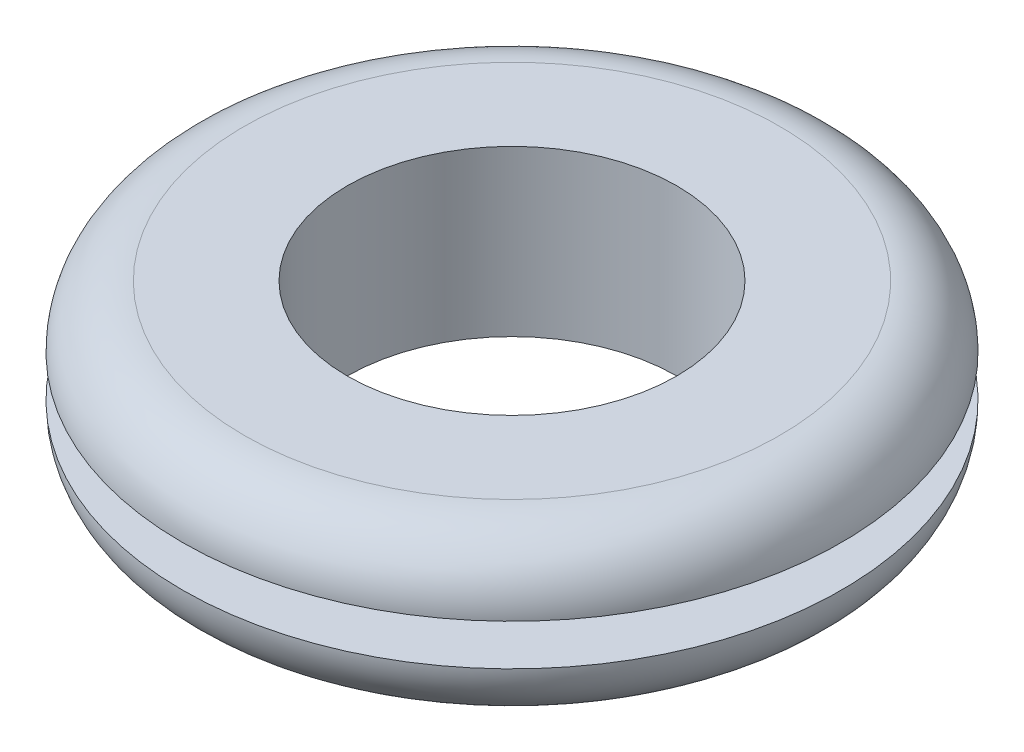
ISO-10303-21;
HEADER;
FILE_DESCRIPTION(('STEP AP214'),'2;1');
FILE_NAME('part.step','',(''),(''),'','','');
FILE_SCHEMA(('AUTOMOTIVE_DESIGN { 1 0 10303 214 1 1 1 1 }'));
ENDSEC;
DATA;
#1=APPLICATION_CONTEXT('core data for automotive mechanical design processes');
#2=APPLICATION_PROTOCOL_DEFINITION('international standard','automotive_design',2000,#1);
#3=PRODUCT_CONTEXT('',#1,'mechanical');
#4=PRODUCT('Part','Part','',(#3));
#5=PRODUCT_RELATED_PRODUCT_CATEGORY('part','',(#4));
#6=PRODUCT_DEFINITION_FORMATION('','',#4);
#7=PRODUCT_DEFINITION_CONTEXT('part definition',#1,'design');
#8=PRODUCT_DEFINITION('design','',#6,#7);
#9=PRODUCT_DEFINITION_SHAPE('','',#8);
#10=(LENGTH_UNIT() NAMED_UNIT(*) SI_UNIT(.MILLI.,.METRE.));
#11=(NAMED_UNIT(*) PLANE_ANGLE_UNIT() SI_UNIT($,.RADIAN.));
#12=(NAMED_UNIT(*) SI_UNIT($,.STERADIAN.) SOLID_ANGLE_UNIT());
#13=UNCERTAINTY_MEASURE_WITH_UNIT(LENGTH_MEASURE(1.E-05),#10,'distance_accuracy_value','');
#14=(GEOMETRIC_REPRESENTATION_CONTEXT(3) GLOBAL_UNCERTAINTY_ASSIGNED_CONTEXT((#13)) GLOBAL_UNIT_ASSIGNED_CONTEXT((#10,
#11,#12)) REPRESENTATION_CONTEXT('',''));
#15=CARTESIAN_POINT('',(0.,0.,0.));
#16=DIRECTION('',(0.,0.,1.));
#17=DIRECTION('',(1.,0.,0.));
#18=AXIS2_PLACEMENT_3D('',#15,#16,#17);
#19=CARTESIAN_POINT('',(0.,3.175,0.));
#20=DIRECTION('',(0.,1.,0.));
#21=DIRECTION('',(0.,0.,1.));
#22=AXIS2_PLACEMENT_3D('',#19,#20,#21);
#23=CYLINDRICAL_SURFACE('',#22,9.525);
#24=CARTESIAN_POINT('',(0.,0.79375,0.));
#25=DIRECTION('',(0.,1.,0.));
#26=DIRECTION('',(0.,0.,1.));
#27=AXIS2_PLACEMENT_3D('',#24,#25,#26);
#28=CIRCLE('',#27,9.525);
#29=CARTESIAN_POINT('',(0.,0.79375,9.525));
#30=VERTEX_POINT('',#29);
#31=EDGE_CURVE('E10',#30,#30,#28,.T.);
#32=ORIENTED_EDGE('',*,*,#31,.F.);
#33=EDGE_LOOP('',(#32));
#34=FACE_BOUND('',#33,.T.);
#35=CARTESIAN_POINT('',(0.,-0.79375,0.));
#36=DIRECTION('',(0.,1.,0.));
#37=DIRECTION('',(0.,0.,1.));
#38=AXIS2_PLACEMENT_3D('',#35,#36,#37);
#39=CIRCLE('',#38,9.525);
#40=CARTESIAN_POINT('',(0.,-0.79375,9.525));
#41=VERTEX_POINT('',#40);
#42=EDGE_CURVE('E56',#41,#41,#39,.T.);
#43=ORIENTED_EDGE('',*,*,#42,.T.);
#44=EDGE_LOOP('',(#43));
#45=FACE_BOUND('',#44,.T.);
#46=ADVANCED_FACE('F28',(#34,#45),#23,.T.);
#47=CARTESIAN_POINT('',(9.525,0.79375,0.));
#48=DIRECTION('',(0.,1.,0.));
#49=DIRECTION('',(0.,0.,1.));
#50=AXIS2_PLACEMENT_3D('',#47,#48,#49);
#51=PLANE('',#50);
#52=CARTESIAN_POINT('',(0.,0.79375,0.));
#53=DIRECTION('',(0.,1.,0.));
#54=DIRECTION('',(0.,0.,1.));
#55=AXIS2_PLACEMENT_3D('',#52,#53,#54);
#56=CIRCLE('',#55,12.7);
#57=CARTESIAN_POINT('',(0.,0.79375,12.7));
#58=VERTEX_POINT('',#57);
#59=EDGE_CURVE('E34',#58,#58,#56,.T.);
#60=ORIENTED_EDGE('',*,*,#59,.F.);
#61=EDGE_LOOP('',(#60));
#62=FACE_BOUND('',#61,.T.);
#63=ORIENTED_EDGE('',*,*,#31,.T.);
#64=EDGE_LOOP('',(#63));
#65=FACE_BOUND('',#64,.T.);
#66=ADVANCED_FACE('F93',(#62,#65),#51,.F.);
#67=CARTESIAN_POINT('',(0.,0.79375,0.));
#68=DIRECTION('',(0.,1.,0.));
#69=DIRECTION('',(0.,0.,1.));
#70=AXIS2_PLACEMENT_3D('',#67,#68,#69);
#71=TOROIDAL_SURFACE('',#70,10.31875,2.38125);
#72=CARTESIAN_POINT('',(0.,3.175,0.));
#73=DIRECTION('',(0.,1.,0.));
#74=DIRECTION('',(0.,0.,1.));
#75=AXIS2_PLACEMENT_3D('',#72,#73,#74);
#76=CIRCLE('',#75,10.31875);
#77=CARTESIAN_POINT('',(0.,3.175,10.31875));
#78=VERTEX_POINT('',#77);
#79=EDGE_CURVE('E38',#78,#78,#76,.T.);
#80=ORIENTED_EDGE('',*,*,#79,.F.);
#81=EDGE_LOOP('',(#80));
#82=FACE_BOUND('',#81,.T.);
#83=ORIENTED_EDGE('',*,*,#59,.T.);
#84=EDGE_LOOP('',(#83));
#85=FACE_BOUND('',#84,.T.);
#86=ADVANCED_FACE('F88',(#82,#85),#71,.T.);
#87=CARTESIAN_POINT('',(6.35,3.175,0.));
#88=DIRECTION('',(0.,-1.,0.));
#89=DIRECTION('',(0.,0.,-1.));
#90=AXIS2_PLACEMENT_3D('',#87,#88,#89);
#91=PLANE('',#90);
#92=CARTESIAN_POINT('',(0.,3.175,0.));
#93=DIRECTION('',(0.,1.,0.));
#94=DIRECTION('',(0.,0.,1.));
#95=AXIS2_PLACEMENT_3D('',#92,#93,#94);
#96=CIRCLE('',#95,6.35);
#97=CARTESIAN_POINT('',(0.,3.175,6.35));
#98=VERTEX_POINT('',#97);
#99=EDGE_CURVE('E42',#98,#98,#96,.T.);
#100=ORIENTED_EDGE('',*,*,#99,.F.);
#101=EDGE_LOOP('',(#100));
#102=FACE_BOUND('',#101,.T.);
#103=ORIENTED_EDGE('',*,*,#79,.T.);
#104=EDGE_LOOP('',(#103));
#105=FACE_BOUND('',#104,.T.);
#106=ADVANCED_FACE('F82',(#102,#105),#91,.F.);
#107=CARTESIAN_POINT('',(0.,3.175,0.));
#108=DIRECTION('',(0.,1.,0.));
#109=DIRECTION('',(0.,0.,1.));
#110=AXIS2_PLACEMENT_3D('',#107,#108,#109);
#111=CYLINDRICAL_SURFACE('',#110,6.35);
#112=CARTESIAN_POINT('',(0.,-3.175,0.));
#113=DIRECTION('',(0.,1.,0.));
#114=DIRECTION('',(0.,0.,1.));
#115=AXIS2_PLACEMENT_3D('',#112,#113,#114);
#116=CIRCLE('',#115,6.35);
#117=CARTESIAN_POINT('',(0.,-3.175,6.35));
#118=VERTEX_POINT('',#117);
#119=EDGE_CURVE('E47',#118,#118,#116,.T.);
#120=ORIENTED_EDGE('',*,*,#119,.F.);
#121=EDGE_LOOP('',(#120));
#122=FACE_BOUND('',#121,.T.);
#123=ORIENTED_EDGE('',*,*,#99,.T.);
#124=EDGE_LOOP('',(#123));
#125=FACE_BOUND('',#124,.T.);
#126=ADVANCED_FACE('F76',(#122,#125),#111,.F.);
#127=CARTESIAN_POINT('',(6.35,-3.175,0.));
#128=DIRECTION('',(0.,1.,0.));
#129=DIRECTION('',(0.,0.,1.));
#130=AXIS2_PLACEMENT_3D('',#127,#128,#129);
#131=PLANE('',#130);
#132=CARTESIAN_POINT('',(0.,-3.175,0.));
#133=DIRECTION('',(0.,1.,0.));
#134=DIRECTION('',(0.,0.,1.));
#135=AXIS2_PLACEMENT_3D('',#132,#133,#134);
#136=CIRCLE('',#135,10.31875);
#137=CARTESIAN_POINT('',(0.,-3.175,10.31875));
#138=VERTEX_POINT('',#137);
#139=EDGE_CURVE('E50',#138,#138,#136,.T.);
#140=ORIENTED_EDGE('',*,*,#139,.F.);
#141=EDGE_LOOP('',(#140));
#142=FACE_BOUND('',#141,.T.);
#143=ORIENTED_EDGE('',*,*,#119,.T.);
#144=EDGE_LOOP('',(#143));
#145=FACE_BOUND('',#144,.T.);
#146=ADVANCED_FACE('F70',(#142,#145),#131,.F.);
#147=CARTESIAN_POINT('',(0.,-0.79375,0.));
#148=DIRECTION('',(0.,1.,0.));
#149=DIRECTION('',(0.,0.,1.));
#150=AXIS2_PLACEMENT_3D('',#147,#148,#149);
#151=TOROIDAL_SURFACE('',#150,10.31875,2.38125);
#152=CARTESIAN_POINT('',(0.,-0.79375,0.));
#153=DIRECTION('',(0.,1.,0.));
#154=DIRECTION('',(0.,0.,1.));
#155=AXIS2_PLACEMENT_3D('',#152,#153,#154);
#156=CIRCLE('',#155,12.7);
#157=CARTESIAN_POINT('',(0.,-0.79375,12.7));
#158=VERTEX_POINT('',#157);
#159=EDGE_CURVE('E53',#158,#158,#156,.T.);
#160=ORIENTED_EDGE('',*,*,#159,.F.);
#161=EDGE_LOOP('',(#160));
#162=FACE_BOUND('',#161,.T.);
#163=ORIENTED_EDGE('',*,*,#139,.T.);
#164=EDGE_LOOP('',(#163));
#165=FACE_BOUND('',#164,.T.);
#166=ADVANCED_FACE('F64',(#162,#165),#151,.T.);
#167=CARTESIAN_POINT('',(12.7,-0.79375,0.));
#168=DIRECTION('',(0.,-1.,0.));
#169=DIRECTION('',(0.,0.,-1.));
#170=AXIS2_PLACEMENT_3D('',#167,#168,#169);
#171=PLANE('',#170);
#172=ORIENTED_EDGE('',*,*,#42,.F.);
#173=EDGE_LOOP('',(#172));
#174=FACE_BOUND('',#173,.T.);
#175=ORIENTED_EDGE('',*,*,#159,.T.);
#176=EDGE_LOOP('',(#175));
#177=FACE_BOUND('',#176,.T.);
#178=ADVANCED_FACE('F61',(#174,#177),#171,.F.);
#179=CLOSED_SHELL('',(#46,#66,#86,#106,#126,#146,#166,#178));
#180=MANIFOLD_SOLID_BREP('B2',#179);
#181=ADVANCED_BREP_SHAPE_REPRESENTATION('',(#18,#180),#14);
#182=SHAPE_DEFINITION_REPRESENTATION(#9,#181);
ENDSEC;
END-ISO-10303-21;
